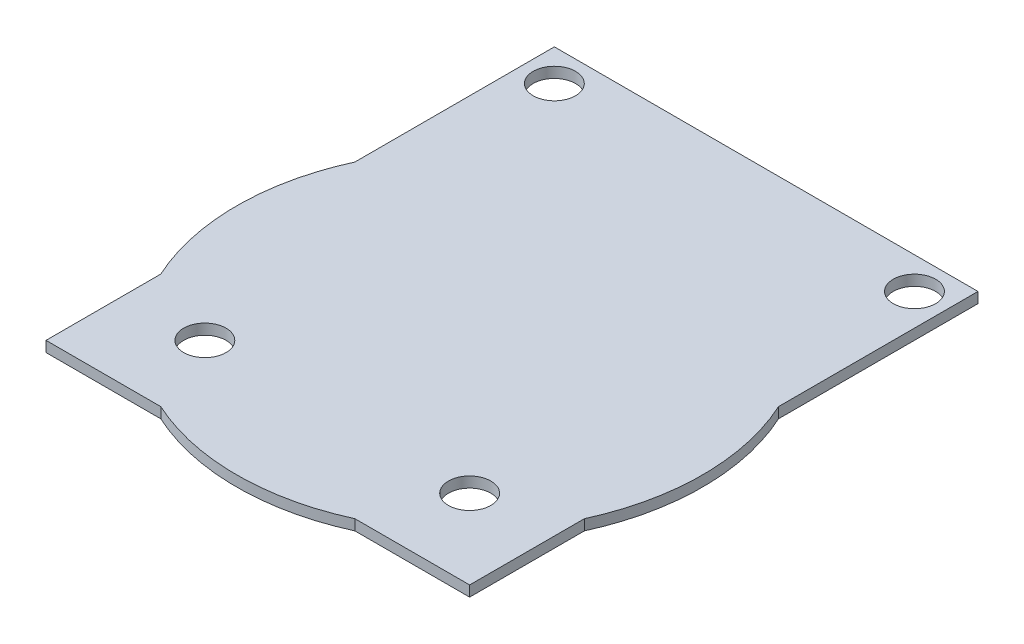
ISO-10303-21;
HEADER;
FILE_DESCRIPTION(('STEP AP214'),'2;1');
FILE_NAME('part.step','',(''),(''),'','','');
FILE_SCHEMA(('AUTOMOTIVE_DESIGN { 1 0 10303 214 1 1 1 1 }'));
ENDSEC;
DATA;
#1=APPLICATION_CONTEXT('core data for automotive mechanical design processes');
#2=APPLICATION_PROTOCOL_DEFINITION('international standard','automotive_design',2000,#1);
#3=PRODUCT_CONTEXT('',#1,'mechanical');
#4=PRODUCT('Part','Part','',(#3));
#5=PRODUCT_RELATED_PRODUCT_CATEGORY('part','',(#4));
#6=PRODUCT_DEFINITION_FORMATION('','',#4);
#7=PRODUCT_DEFINITION_CONTEXT('part definition',#1,'design');
#8=PRODUCT_DEFINITION('design','',#6,#7);
#9=PRODUCT_DEFINITION_SHAPE('','',#8);
#10=(LENGTH_UNIT() NAMED_UNIT(*) SI_UNIT(.MILLI.,.METRE.));
#11=(NAMED_UNIT(*) PLANE_ANGLE_UNIT() SI_UNIT($,.RADIAN.));
#12=(NAMED_UNIT(*) SI_UNIT($,.STERADIAN.) SOLID_ANGLE_UNIT());
#13=UNCERTAINTY_MEASURE_WITH_UNIT(LENGTH_MEASURE(1.E-05),#10,'distance_accuracy_value','');
#14=(GEOMETRIC_REPRESENTATION_CONTEXT(3) GLOBAL_UNCERTAINTY_ASSIGNED_CONTEXT((#13)) GLOBAL_UNIT_ASSIGNED_CONTEXT((#10,
#11,#12)) REPRESENTATION_CONTEXT('',''));
#15=CARTESIAN_POINT('',(0.,0.,0.));
#16=DIRECTION('',(0.,0.,1.));
#17=DIRECTION('',(1.,0.,0.));
#18=AXIS2_PLACEMENT_3D('',#15,#16,#17);
#19=CARTESIAN_POINT('',(-27.7978877099629,1.,0.));
#20=DIRECTION('',(1.,0.,0.));
#21=DIRECTION('',(0.,0.,-1.));
#22=AXIS2_PLACEMENT_3D('',#19,#20,#21);
#23=PLANE('',#22);
#24=DIRECTION('',(0.,0.,1.));
#25=VECTOR('',#24,1.);
#26=CARTESIAN_POINT('',(-27.7978877099629,0.,0.));
#27=LINE('',#26,#25);
#28=CARTESIAN_POINT('',(-27.7978877099629,0.,-17.1723700679775));
#29=VERTEX_POINT('',#28);
#30=CARTESIAN_POINT('',(-27.7978877099629,0.,1.66247854211089));
#31=VERTEX_POINT('',#30);
#32=EDGE_CURVE('E164',#29,#31,#27,.T.);
#33=ORIENTED_EDGE('',*,*,#32,.T.);
#34=DIRECTION('',(0.,-1.,0.));
#35=VECTOR('',#34,1.);
#36=CARTESIAN_POINT('',(-27.7978877099629,1.,1.66247854211089));
#37=LINE('',#36,#35);
#38=CARTESIAN_POINT('',(-27.7978877099629,1.,1.66247854211089));
#39=VERTEX_POINT('',#38);
#40=EDGE_CURVE('E11',#39,#31,#37,.T.);
#41=ORIENTED_EDGE('',*,*,#40,.F.);
#42=DIRECTION('',(0.,0.,1.));
#43=VECTOR('',#42,1.);
#44=CARTESIAN_POINT('',(-27.7978877099629,1.,0.));
#45=LINE('',#44,#43);
#46=CARTESIAN_POINT('',(-27.7978877099629,1.,-17.1723700679775));
#47=VERTEX_POINT('',#46);
#48=EDGE_CURVE('E198',#47,#39,#45,.T.);
#49=ORIENTED_EDGE('',*,*,#48,.F.);
#50=DIRECTION('',(0.,-1.,0.));
#51=VECTOR('',#50,1.);
#52=CARTESIAN_POINT('',(-27.7978877099629,1.,-17.1723700679775));
#53=LINE('',#52,#51);
#54=EDGE_CURVE('E59',#47,#29,#53,.T.);
#55=ORIENTED_EDGE('',*,*,#54,.T.);
#56=EDGE_LOOP('',(#33,#41,#49,#55));
#57=FACE_BOUND('',#56,.T.);
#58=ADVANCED_FACE('F43',(#57),#23,.F.);
#59=CARTESIAN_POINT('',(-7.79788770996293,1.,10.8276299320226));
#60=DIRECTION('',(0.,-1.,0.));
#61=DIRECTION('',(0.,0.,-1.));
#62=AXIS2_PLACEMENT_3D('',#59,#60,#61);
#63=CYLINDRICAL_SURFACE('',#62,22.);
#64=CARTESIAN_POINT('',(-7.79788770996293,0.,10.8276299320226));
#65=DIRECTION('',(0.,1.,0.));
#66=DIRECTION('',(0.,0.,1.));
#67=AXIS2_PLACEMENT_3D('',#64,#65,#66);
#68=CIRCLE('',#67,22.);
#69=CARTESIAN_POINT('',(-27.7978877099629,0.,19.9927813219342));
#70=VERTEX_POINT('',#69);
#71=EDGE_CURVE('E166',#31,#70,#68,.T.);
#72=ORIENTED_EDGE('',*,*,#71,.T.);
#73=DIRECTION('',(0.,-1.,0.));
#74=VECTOR('',#73,1.);
#75=CARTESIAN_POINT('',(-27.7978877099629,1.,19.9927813219342));
#76=LINE('',#75,#74);
#77=CARTESIAN_POINT('',(-27.7978877099629,1.,19.9927813219342));
#78=VERTEX_POINT('',#77);
#79=EDGE_CURVE('E51',#78,#70,#76,.T.);
#80=ORIENTED_EDGE('',*,*,#79,.F.);
#81=CARTESIAN_POINT('',(-7.79788770996293,1.,10.8276299320226));
#82=DIRECTION('',(0.,1.,0.));
#83=DIRECTION('',(0.,0.,1.));
#84=AXIS2_PLACEMENT_3D('',#81,#82,#83);
#85=CIRCLE('',#84,22.);
#86=EDGE_CURVE('E103',#39,#78,#85,.T.);
#87=ORIENTED_EDGE('',*,*,#86,.F.);
#88=ORIENTED_EDGE('',*,*,#40,.T.);
#89=EDGE_LOOP('',(#72,#80,#87,#88));
#90=FACE_BOUND('',#89,.T.);
#91=ADVANCED_FACE('F261',(#90),#63,.T.);
#92=CARTESIAN_POINT('',(-27.7978877099629,1.,0.));
#93=DIRECTION('',(1.,0.,0.));
#94=DIRECTION('',(0.,0.,-1.));
#95=AXIS2_PLACEMENT_3D('',#92,#93,#94);
#96=PLANE('',#95);
#97=DIRECTION('',(0.,0.,1.));
#98=VECTOR('',#97,1.);
#99=CARTESIAN_POINT('',(-27.7978877099629,0.,0.));
#100=LINE('',#99,#98);
#101=CARTESIAN_POINT('',(-27.7978877099629,0.,30.8276299320226));
#102=VERTEX_POINT('',#101);
#103=EDGE_CURVE('E168',#70,#102,#100,.T.);
#104=ORIENTED_EDGE('',*,*,#103,.T.);
#105=DIRECTION('',(0.,-1.,0.));
#106=VECTOR('',#105,1.);
#107=CARTESIAN_POINT('',(-27.7978877099629,1.,30.8276299320226));
#108=LINE('',#107,#106);
#109=CARTESIAN_POINT('',(-27.7978877099629,1.,30.8276299320226));
#110=VERTEX_POINT('',#109);
#111=EDGE_CURVE('E210',#110,#102,#108,.T.);
#112=ORIENTED_EDGE('',*,*,#111,.F.);
#113=DIRECTION('',(0.,0.,1.));
#114=VECTOR('',#113,1.);
#115=CARTESIAN_POINT('',(-27.7978877099629,1.,0.));
#116=LINE('',#115,#114);
#117=EDGE_CURVE('E218',#78,#110,#116,.T.);
#118=ORIENTED_EDGE('',*,*,#117,.F.);
#119=ORIENTED_EDGE('',*,*,#79,.T.);
#120=EDGE_LOOP('',(#104,#112,#118,#119));
#121=FACE_BOUND('',#120,.T.);
#122=ADVANCED_FACE('F216',(#121),#96,.F.);
#123=CARTESIAN_POINT('',(0.,1.,30.8276299320226));
#124=DIRECTION('',(0.,0.,-1.));
#125=DIRECTION('',(-1.,0.,0.));
#126=AXIS2_PLACEMENT_3D('',#123,#124,#125);
#127=PLANE('',#126);
#128=DIRECTION('',(1.,0.,0.));
#129=VECTOR('',#128,1.);
#130=CARTESIAN_POINT('',(0.,0.,30.8276299320226));
#131=LINE('',#130,#129);
#132=CARTESIAN_POINT('',(-16.9630390998747,0.,30.8276299320226));
#133=VERTEX_POINT('',#132);
#134=EDGE_CURVE('E170',#102,#133,#131,.T.);
#135=ORIENTED_EDGE('',*,*,#134,.T.);
#136=DIRECTION('',(0.,-1.,0.));
#137=VECTOR('',#136,1.);
#138=CARTESIAN_POINT('',(-16.9630390998747,1.,30.8276299320226));
#139=LINE('',#138,#137);
#140=CARTESIAN_POINT('',(-16.9630390998747,1.,30.8276299320226));
#141=VERTEX_POINT('',#140);
#142=EDGE_CURVE('E207',#141,#133,#139,.T.);
#143=ORIENTED_EDGE('',*,*,#142,.F.);
#144=DIRECTION('',(1.,0.,0.));
#145=VECTOR('',#144,1.);
#146=CARTESIAN_POINT('',(0.,1.,30.8276299320226));
#147=LINE('',#146,#145);
#148=EDGE_CURVE('E236',#110,#141,#147,.T.);
#149=ORIENTED_EDGE('',*,*,#148,.F.);
#150=ORIENTED_EDGE('',*,*,#111,.T.);
#151=EDGE_LOOP('',(#135,#143,#149,#150));
#152=FACE_BOUND('',#151,.T.);
#153=ADVANCED_FACE('F227',(#152),#127,.F.);
#154=CARTESIAN_POINT('',(-7.79788770996293,1.,10.8276299320226));
#155=DIRECTION('',(0.,-1.,0.));
#156=DIRECTION('',(0.,0.,-1.));
#157=AXIS2_PLACEMENT_3D('',#154,#155,#156);
#158=CYLINDRICAL_SURFACE('',#157,22.);
#159=CARTESIAN_POINT('',(-7.79788770996293,0.,10.8276299320226));
#160=DIRECTION('',(0.,1.,0.));
#161=DIRECTION('',(0.,0.,1.));
#162=AXIS2_PLACEMENT_3D('',#159,#160,#161);
#163=CIRCLE('',#162,22.);
#164=CARTESIAN_POINT('',(1.36726367994882,0.,30.8276299320226));
#165=VERTEX_POINT('',#164);
#166=EDGE_CURVE('E172',#133,#165,#163,.T.);
#167=ORIENTED_EDGE('',*,*,#166,.T.);
#168=DIRECTION('',(0.,-1.,0.));
#169=VECTOR('',#168,1.);
#170=CARTESIAN_POINT('',(1.36726367994882,1.,30.8276299320226));
#171=LINE('',#170,#169);
#172=CARTESIAN_POINT('',(1.36726367994882,1.,30.8276299320226));
#173=VERTEX_POINT('',#172);
#174=EDGE_CURVE('E204',#173,#165,#171,.T.);
#175=ORIENTED_EDGE('',*,*,#174,.F.);
#176=CARTESIAN_POINT('',(-7.79788770996293,1.,10.8276299320226));
#177=DIRECTION('',(0.,1.,0.));
#178=DIRECTION('',(0.,0.,1.));
#179=AXIS2_PLACEMENT_3D('',#176,#177,#178);
#180=CIRCLE('',#179,22.);
#181=EDGE_CURVE('E233',#141,#173,#180,.T.);
#182=ORIENTED_EDGE('',*,*,#181,.F.);
#183=ORIENTED_EDGE('',*,*,#142,.T.);
#184=EDGE_LOOP('',(#167,#175,#182,#183));
#185=FACE_BOUND('',#184,.T.);
#186=ADVANCED_FACE('F231',(#185),#158,.T.);
#187=CARTESIAN_POINT('',(0.,1.,30.8276299320226));
#188=DIRECTION('',(0.,0.,-1.));
#189=DIRECTION('',(-1.,0.,0.));
#190=AXIS2_PLACEMENT_3D('',#187,#188,#189);
#191=PLANE('',#190);
#192=DIRECTION('',(1.,0.,0.));
#193=VECTOR('',#192,1.);
#194=CARTESIAN_POINT('',(0.,0.,30.8276299320226));
#195=LINE('',#194,#193);
#196=CARTESIAN_POINT('',(12.2021122900371,0.,30.8276299320226));
#197=VERTEX_POINT('',#196);
#198=EDGE_CURVE('E174',#165,#197,#195,.T.);
#199=ORIENTED_EDGE('',*,*,#198,.T.);
#200=DIRECTION('',(0.,-1.,0.));
#201=VECTOR('',#200,1.);
#202=CARTESIAN_POINT('',(12.2021122900371,1.,30.8276299320226));
#203=LINE('',#202,#201);
#204=CARTESIAN_POINT('',(12.2021122900371,1.,30.8276299320226));
#205=VERTEX_POINT('',#204);
#206=EDGE_CURVE('E202',#205,#197,#203,.T.);
#207=ORIENTED_EDGE('',*,*,#206,.F.);
#208=DIRECTION('',(1.,0.,0.));
#209=VECTOR('',#208,1.);
#210=CARTESIAN_POINT('',(0.,1.,30.8276299320226));
#211=LINE('',#210,#209);
#212=EDGE_CURVE('E235',#173,#205,#211,.T.);
#213=ORIENTED_EDGE('',*,*,#212,.F.);
#214=ORIENTED_EDGE('',*,*,#174,.T.);
#215=EDGE_LOOP('',(#199,#207,#213,#214));
#216=FACE_BOUND('',#215,.T.);
#217=ADVANCED_FACE('F277',(#216),#191,.F.);
#218=CARTESIAN_POINT('',(12.202112290037,1.,0.));
#219=DIRECTION('',(1.,0.,0.));
#220=DIRECTION('',(0.,0.,-1.));
#221=AXIS2_PLACEMENT_3D('',#218,#219,#220);
#222=PLANE('',#221);
#223=DIRECTION('',(0.,0.,1.));
#224=VECTOR('',#223,1.);
#225=CARTESIAN_POINT('',(12.202112290037,0.,0.));
#226=LINE('',#225,#224);
#227=CARTESIAN_POINT('',(12.2021122900371,0.,19.9927813219343));
#228=VERTEX_POINT('',#227);
#229=EDGE_CURVE('E177',#228,#197,#226,.T.);
#230=ORIENTED_EDGE('',*,*,#229,.F.);
#231=DIRECTION('',(0.,-1.,0.));
#232=VECTOR('',#231,1.);
#233=CARTESIAN_POINT('',(12.2021122900371,1.,19.9927813219343));
#234=LINE('',#233,#232);
#235=CARTESIAN_POINT('',(12.2021122900371,1.,19.9927813219343));
#236=VERTEX_POINT('',#235);
#237=EDGE_CURVE('E144',#236,#228,#234,.T.);
#238=ORIENTED_EDGE('',*,*,#237,.F.);
#239=DIRECTION('',(0.,0.,1.));
#240=VECTOR('',#239,1.);
#241=CARTESIAN_POINT('',(12.202112290037,1.,0.));
#242=LINE('',#241,#240);
#243=EDGE_CURVE('E134',#236,#205,#242,.T.);
#244=ORIENTED_EDGE('',*,*,#243,.T.);
#245=ORIENTED_EDGE('',*,*,#206,.T.);
#246=EDGE_LOOP('',(#230,#238,#244,#245));
#247=FACE_BOUND('',#246,.T.);
#248=ADVANCED_FACE('F243',(#247),#222,.T.);
#249=CARTESIAN_POINT('',(-7.79788770996293,1.,10.8276299320226));
#250=DIRECTION('',(0.,-1.,0.));
#251=DIRECTION('',(0.,0.,-1.));
#252=AXIS2_PLACEMENT_3D('',#249,#250,#251);
#253=CYLINDRICAL_SURFACE('',#252,22.);
#254=CARTESIAN_POINT('',(-7.79788770996293,0.,10.8276299320226));
#255=DIRECTION('',(0.,1.,0.));
#256=DIRECTION('',(0.,0.,1.));
#257=AXIS2_PLACEMENT_3D('',#254,#255,#256);
#258=CIRCLE('',#257,22.);
#259=CARTESIAN_POINT('',(12.202112290037,0.,1.66247854211077));
#260=VERTEX_POINT('',#259);
#261=EDGE_CURVE('E141',#228,#260,#258,.T.);
#262=ORIENTED_EDGE('',*,*,#261,.T.);
#263=DIRECTION('',(0.,-1.,0.));
#264=VECTOR('',#263,1.);
#265=CARTESIAN_POINT('',(12.202112290037,1.,1.66247854211077));
#266=LINE('',#265,#264);
#267=CARTESIAN_POINT('',(12.202112290037,1.,1.66247854211077));
#268=VERTEX_POINT('',#267);
#269=EDGE_CURVE('E138',#268,#260,#266,.T.);
#270=ORIENTED_EDGE('',*,*,#269,.F.);
#271=CARTESIAN_POINT('',(-7.79788770996293,1.,10.8276299320226));
#272=DIRECTION('',(0.,1.,0.));
#273=DIRECTION('',(0.,0.,1.));
#274=AXIS2_PLACEMENT_3D('',#271,#272,#273);
#275=CIRCLE('',#274,22.);
#276=EDGE_CURVE('E126',#236,#268,#275,.T.);
#277=ORIENTED_EDGE('',*,*,#276,.F.);
#278=ORIENTED_EDGE('',*,*,#237,.T.);
#279=EDGE_LOOP('',(#262,#270,#277,#278));
#280=FACE_BOUND('',#279,.T.);
#281=ADVANCED_FACE('F139',(#280),#253,.T.);
#282=CARTESIAN_POINT('',(12.202112290037,1.,0.));
#283=DIRECTION('',(1.,0.,0.));
#284=DIRECTION('',(0.,0.,-1.));
#285=AXIS2_PLACEMENT_3D('',#282,#283,#284);
#286=PLANE('',#285);
#287=DIRECTION('',(0.,0.,1.));
#288=VECTOR('',#287,1.);
#289=CARTESIAN_POINT('',(12.202112290037,0.,0.));
#290=LINE('',#289,#288);
#291=CARTESIAN_POINT('',(12.202112290037,0.,-17.1723700679775));
#292=VERTEX_POINT('',#291);
#293=EDGE_CURVE('E181',#292,#260,#290,.T.);
#294=ORIENTED_EDGE('',*,*,#293,.F.);
#295=DIRECTION('',(0.,-1.,0.));
#296=VECTOR('',#295,1.);
#297=CARTESIAN_POINT('',(12.202112290037,1.,-17.1723700679775));
#298=LINE('',#297,#296);
#299=CARTESIAN_POINT('',(12.202112290037,1.,-17.1723700679775));
#300=VERTEX_POINT('',#299);
#301=EDGE_CURVE('E91',#300,#292,#298,.T.);
#302=ORIENTED_EDGE('',*,*,#301,.F.);
#303=DIRECTION('',(0.,0.,1.));
#304=VECTOR('',#303,1.);
#305=CARTESIAN_POINT('',(12.202112290037,1.,0.));
#306=LINE('',#305,#304);
#307=EDGE_CURVE('E132',#300,#268,#306,.T.);
#308=ORIENTED_EDGE('',*,*,#307,.T.);
#309=ORIENTED_EDGE('',*,*,#269,.T.);
#310=EDGE_LOOP('',(#294,#302,#308,#309));
#311=FACE_BOUND('',#310,.T.);
#312=ADVANCED_FACE('F146',(#311),#286,.T.);
#313=CARTESIAN_POINT('',(-20.2978877099629,1.,23.3276299320225));
#314=DIRECTION('',(0.,-1.,0.));
#315=DIRECTION('',(0.,0.,-1.));
#316=AXIS2_PLACEMENT_3D('',#313,#314,#315);
#317=CYLINDRICAL_SURFACE('',#316,2.);
#318=CARTESIAN_POINT('',(-20.2978877099629,1.,23.3276299320225));
#319=DIRECTION('',(0.,1.,0.));
#320=DIRECTION('',(0.,0.,1.));
#321=AXIS2_PLACEMENT_3D('',#318,#319,#320);
#322=CIRCLE('',#321,2.);
#323=CARTESIAN_POINT('',(-20.2978877099629,1.,25.3276299320225));
#324=VERTEX_POINT('',#323);
#325=EDGE_CURVE('E158',#324,#324,#322,.T.);
#326=ORIENTED_EDGE('',*,*,#325,.T.);
#327=EDGE_LOOP('',(#326));
#328=FACE_BOUND('',#327,.T.);
#329=CARTESIAN_POINT('',(-20.2978877099629,0.,23.3276299320225));
#330=DIRECTION('',(0.,1.,0.));
#331=DIRECTION('',(0.,0.,1.));
#332=AXIS2_PLACEMENT_3D('',#329,#330,#331);
#333=CIRCLE('',#332,2.);
#334=CARTESIAN_POINT('',(-20.2978877099629,0.,25.3276299320225));
#335=VERTEX_POINT('',#334);
#336=EDGE_CURVE('E192',#335,#335,#333,.T.);
#337=ORIENTED_EDGE('',*,*,#336,.F.);
#338=EDGE_LOOP('',(#337));
#339=FACE_BOUND('',#338,.T.);
#340=ADVANCED_FACE('F285',(#328,#339),#317,.F.);
#341=CARTESIAN_POINT('',(9.20211229003706,1.,-14.1723700679775));
#342=DIRECTION('',(0.,-1.,0.));
#343=DIRECTION('',(0.,0.,-1.));
#344=AXIS2_PLACEMENT_3D('',#341,#342,#343);
#345=CYLINDRICAL_SURFACE('',#344,2.00000000000001);
#346=CARTESIAN_POINT('',(9.20211229003706,1.,-14.1723700679775));
#347=DIRECTION('',(0.,1.,0.));
#348=DIRECTION('',(0.,0.,1.));
#349=AXIS2_PLACEMENT_3D('',#346,#347,#348);
#350=CIRCLE('',#349,2.00000000000001);
#351=CARTESIAN_POINT('',(9.20211229003706,1.,-12.1723700679774));
#352=VERTEX_POINT('',#351);
#353=EDGE_CURVE('E155',#352,#352,#350,.F.);
#354=ORIENTED_EDGE('',*,*,#353,.F.);
#355=EDGE_LOOP('',(#354));
#356=FACE_BOUND('',#355,.T.);
#357=CARTESIAN_POINT('',(9.20211229003706,0.,-14.1723700679775));
#358=DIRECTION('',(0.,1.,0.));
#359=DIRECTION('',(0.,0.,1.));
#360=AXIS2_PLACEMENT_3D('',#357,#358,#359);
#361=CIRCLE('',#360,2.00000000000001);
#362=CARTESIAN_POINT('',(9.20211229003706,0.,-12.1723700679774));
#363=VERTEX_POINT('',#362);
#364=EDGE_CURVE('E189',#363,#363,#361,.F.);
#365=ORIENTED_EDGE('',*,*,#364,.T.);
#366=EDGE_LOOP('',(#365));
#367=FACE_BOUND('',#366,.T.);
#368=ADVANCED_FACE('F256',(#356,#367),#345,.F.);
#369=CARTESIAN_POINT('',(-24.7978877099629,1.,-14.1723700679774));
#370=DIRECTION('',(0.,-1.,0.));
#371=DIRECTION('',(0.,0.,-1.));
#372=AXIS2_PLACEMENT_3D('',#369,#370,#371);
#373=CYLINDRICAL_SURFACE('',#372,2.);
#374=CARTESIAN_POINT('',(-24.7978877099629,1.,-14.1723700679774));
#375=DIRECTION('',(0.,1.,0.));
#376=DIRECTION('',(0.,0.,1.));
#377=AXIS2_PLACEMENT_3D('',#374,#375,#376);
#378=CIRCLE('',#377,2.);
#379=CARTESIAN_POINT('',(-24.7978877099629,1.,-12.1723700679774));
#380=VERTEX_POINT('',#379);
#381=EDGE_CURVE('E149',#380,#380,#378,.T.);
#382=ORIENTED_EDGE('',*,*,#381,.T.);
#383=EDGE_LOOP('',(#382));
#384=FACE_BOUND('',#383,.T.);
#385=CARTESIAN_POINT('',(-24.7978877099629,0.,-14.1723700679774));
#386=DIRECTION('',(0.,1.,0.));
#387=DIRECTION('',(0.,0.,1.));
#388=AXIS2_PLACEMENT_3D('',#385,#386,#387);
#389=CIRCLE('',#388,2.);
#390=CARTESIAN_POINT('',(-24.7978877099629,0.,-12.1723700679774));
#391=VERTEX_POINT('',#390);
#392=EDGE_CURVE('E186',#391,#391,#389,.T.);
#393=ORIENTED_EDGE('',*,*,#392,.F.);
#394=EDGE_LOOP('',(#393));
#395=FACE_BOUND('',#394,.T.);
#396=ADVANCED_FACE('F248',(#384,#395),#373,.F.);
#397=CARTESIAN_POINT('',(0.,1.,-17.1723700679775));
#398=DIRECTION('',(0.,0.,-1.));
#399=DIRECTION('',(-1.,0.,0.));
#400=AXIS2_PLACEMENT_3D('',#397,#398,#399);
#401=PLANE('',#400);
#402=DIRECTION('',(1.,0.,0.));
#403=VECTOR('',#402,1.);
#404=CARTESIAN_POINT('',(0.,0.,-17.1723700679775));
#405=LINE('',#404,#403);
#406=EDGE_CURVE('E183',#29,#292,#405,.T.);
#407=ORIENTED_EDGE('',*,*,#406,.F.);
#408=ORIENTED_EDGE('',*,*,#54,.F.);
#409=DIRECTION('',(1.,0.,0.));
#410=VECTOR('',#409,1.);
#411=CARTESIAN_POINT('',(0.,1.,-17.1723700679775));
#412=LINE('',#411,#410);
#413=EDGE_CURVE('E147',#47,#300,#412,.T.);
#414=ORIENTED_EDGE('',*,*,#413,.T.);
#415=ORIENTED_EDGE('',*,*,#301,.T.);
#416=EDGE_LOOP('',(#407,#408,#414,#415));
#417=FACE_BOUND('',#416,.T.);
#418=ADVANCED_FACE('F245',(#417),#401,.T.);
#419=CARTESIAN_POINT('',(4.70211229003706,1.,23.3276299320225));
#420=DIRECTION('',(0.,-1.,0.));
#421=DIRECTION('',(0.,0.,-1.));
#422=AXIS2_PLACEMENT_3D('',#419,#420,#421);
#423=CYLINDRICAL_SURFACE('',#422,2.00000000000001);
#424=CARTESIAN_POINT('',(4.70211229003706,1.,23.3276299320225));
#425=DIRECTION('',(0.,1.,0.));
#426=DIRECTION('',(0.,0.,1.));
#427=AXIS2_PLACEMENT_3D('',#424,#425,#426);
#428=CIRCLE('',#427,2.00000000000001);
#429=CARTESIAN_POINT('',(4.70211229003706,1.,25.3276299320226));
#430=VERTEX_POINT('',#429);
#431=EDGE_CURVE('E161',#430,#430,#428,.F.);
#432=ORIENTED_EDGE('',*,*,#431,.F.);
#433=EDGE_LOOP('',(#432));
#434=FACE_BOUND('',#433,.T.);
#435=CARTESIAN_POINT('',(4.70211229003706,0.,23.3276299320225));
#436=DIRECTION('',(0.,1.,0.));
#437=DIRECTION('',(0.,0.,1.));
#438=AXIS2_PLACEMENT_3D('',#435,#436,#437);
#439=CIRCLE('',#438,2.00000000000001);
#440=CARTESIAN_POINT('',(4.70211229003706,0.,25.3276299320226));
#441=VERTEX_POINT('',#440);
#442=EDGE_CURVE('E195',#441,#441,#439,.F.);
#443=ORIENTED_EDGE('',*,*,#442,.T.);
#444=EDGE_LOOP('',(#443));
#445=FACE_BOUND('',#444,.T.);
#446=ADVANCED_FACE('F247',(#434,#445),#423,.F.);
#447=CARTESIAN_POINT('',(0.,1.,0.));
#448=DIRECTION('',(0.,1.,0.));
#449=DIRECTION('',(0.,0.,1.));
#450=AXIS2_PLACEMENT_3D('',#447,#448,#449);
#451=PLANE('',#450);
#452=ORIENTED_EDGE('',*,*,#48,.T.);
#453=ORIENTED_EDGE('',*,*,#86,.T.);
#454=ORIENTED_EDGE('',*,*,#117,.T.);
#455=ORIENTED_EDGE('',*,*,#148,.T.);
#456=ORIENTED_EDGE('',*,*,#181,.T.);
#457=ORIENTED_EDGE('',*,*,#212,.T.);
#458=ORIENTED_EDGE('',*,*,#243,.F.);
#459=ORIENTED_EDGE('',*,*,#276,.T.);
#460=ORIENTED_EDGE('',*,*,#307,.F.);
#461=ORIENTED_EDGE('',*,*,#413,.F.);
#462=EDGE_LOOP('',(#452,#453,#454,#455,#456,#457,#458,#459,#460,#461));
#463=FACE_BOUND('',#462,.T.);
#464=ORIENTED_EDGE('',*,*,#381,.F.);
#465=EDGE_LOOP('',(#464));
#466=FACE_BOUND('',#465,.T.);
#467=ORIENTED_EDGE('',*,*,#353,.T.);
#468=EDGE_LOOP('',(#467));
#469=FACE_BOUND('',#468,.T.);
#470=ORIENTED_EDGE('',*,*,#325,.F.);
#471=EDGE_LOOP('',(#470));
#472=FACE_BOUND('',#471,.T.);
#473=ORIENTED_EDGE('',*,*,#431,.T.);
#474=EDGE_LOOP('',(#473));
#475=FACE_BOUND('',#474,.T.);
#476=ADVANCED_FACE('F128',(#463,#466,#469,#472,#475),#451,.T.);
#477=CARTESIAN_POINT('',(0.,0.,0.));
#478=DIRECTION('',(0.,1.,0.));
#479=DIRECTION('',(0.,0.,1.));
#480=AXIS2_PLACEMENT_3D('',#477,#478,#479);
#481=PLANE('',#480);
#482=ORIENTED_EDGE('',*,*,#32,.F.);
#483=ORIENTED_EDGE('',*,*,#406,.T.);
#484=ORIENTED_EDGE('',*,*,#293,.T.);
#485=ORIENTED_EDGE('',*,*,#261,.F.);
#486=ORIENTED_EDGE('',*,*,#229,.T.);
#487=ORIENTED_EDGE('',*,*,#198,.F.);
#488=ORIENTED_EDGE('',*,*,#166,.F.);
#489=ORIENTED_EDGE('',*,*,#134,.F.);
#490=ORIENTED_EDGE('',*,*,#103,.F.);
#491=ORIENTED_EDGE('',*,*,#71,.F.);
#492=EDGE_LOOP('',(#482,#483,#484,#485,#486,#487,#488,#489,#490,#491));
#493=FACE_BOUND('',#492,.T.);
#494=ORIENTED_EDGE('',*,*,#392,.T.);
#495=EDGE_LOOP('',(#494));
#496=FACE_BOUND('',#495,.T.);
#497=ORIENTED_EDGE('',*,*,#364,.F.);
#498=EDGE_LOOP('',(#497));
#499=FACE_BOUND('',#498,.T.);
#500=ORIENTED_EDGE('',*,*,#336,.T.);
#501=EDGE_LOOP('',(#500));
#502=FACE_BOUND('',#501,.T.);
#503=ORIENTED_EDGE('',*,*,#442,.F.);
#504=EDGE_LOOP('',(#503));
#505=FACE_BOUND('',#504,.T.);
#506=ADVANCED_FACE('F221',(#493,#496,#499,#502,#505),#481,.F.);
#507=CLOSED_SHELL('',(#58,#91,#122,#153,#186,#217,#248,#281,#312,#340,#368,#396,#418,#446,#476,#506));
#508=MANIFOLD_SOLID_BREP('B2',#507);
#509=ADVANCED_BREP_SHAPE_REPRESENTATION('',(#18,#508),#14);
#510=SHAPE_DEFINITION_REPRESENTATION(#9,#509);
ENDSEC;
END-ISO-10303-21;
